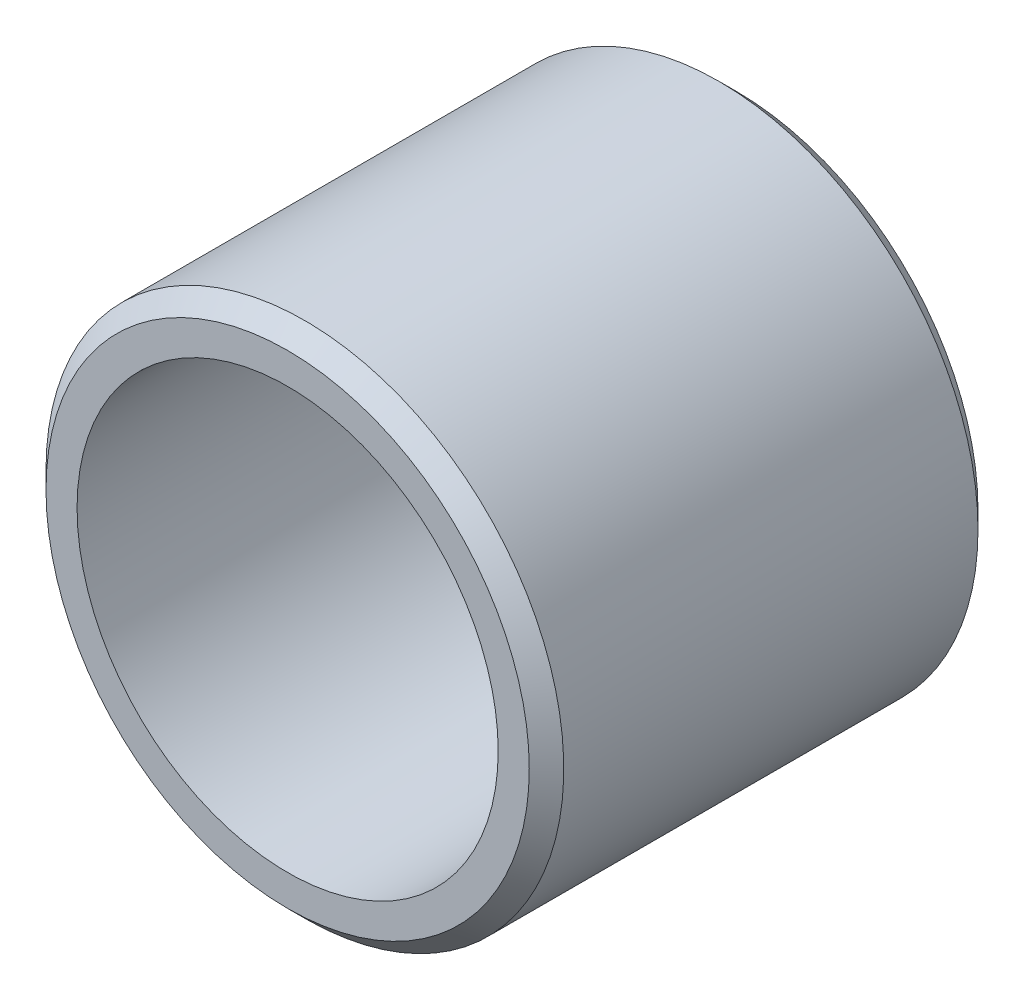
ISO-10303-21;
HEADER;
FILE_DESCRIPTION(('STEP AP214'),'2;1');
FILE_NAME('part.step','',(''),(''),'','','');
FILE_SCHEMA(('AUTOMOTIVE_DESIGN { 1 0 10303 214 1 1 1 1 }'));
ENDSEC;
DATA;
#1=APPLICATION_CONTEXT('core data for automotive mechanical design processes');
#2=APPLICATION_PROTOCOL_DEFINITION('international standard','automotive_design',2000,#1);
#3=PRODUCT_CONTEXT('',#1,'mechanical');
#4=PRODUCT('Part','Part','',(#3));
#5=PRODUCT_RELATED_PRODUCT_CATEGORY('part','',(#4));
#6=PRODUCT_DEFINITION_FORMATION('','',#4);
#7=PRODUCT_DEFINITION_CONTEXT('part definition',#1,'design');
#8=PRODUCT_DEFINITION('design','',#6,#7);
#9=PRODUCT_DEFINITION_SHAPE('','',#8);
#10=(LENGTH_UNIT() NAMED_UNIT(*) SI_UNIT(.MILLI.,.METRE.));
#11=(NAMED_UNIT(*) PLANE_ANGLE_UNIT() SI_UNIT($,.RADIAN.));
#12=(NAMED_UNIT(*) SI_UNIT($,.STERADIAN.) SOLID_ANGLE_UNIT());
#13=UNCERTAINTY_MEASURE_WITH_UNIT(LENGTH_MEASURE(1.E-05),#10,'distance_accuracy_value','');
#14=(GEOMETRIC_REPRESENTATION_CONTEXT(3) GLOBAL_UNCERTAINTY_ASSIGNED_CONTEXT((#13)) GLOBAL_UNIT_ASSIGNED_CONTEXT((#10,
#11,#12)) REPRESENTATION_CONTEXT('',''));
#15=CARTESIAN_POINT('',(0.,0.,0.));
#16=DIRECTION('',(0.,0.,1.));
#17=DIRECTION('',(1.,0.,0.));
#18=AXIS2_PLACEMENT_3D('',#15,#16,#17);
#19=CARTESIAN_POINT('',(0.,0.,13.));
#20=DIRECTION('',(0.,0.,-1.));
#21=DIRECTION('',(-1.,0.,0.));
#22=AXIS2_PLACEMENT_3D('',#19,#20,#21);
#23=CYLINDRICAL_SURFACE('',#22,6.1);
#24=CARTESIAN_POINT('',(0.,0.,0.));
#25=DIRECTION('',(0.,0.,-1.));
#26=DIRECTION('',(-1.,0.,0.));
#27=AXIS2_PLACEMENT_3D('',#24,#25,#26);
#28=CIRCLE('',#27,6.1);
#29=CARTESIAN_POINT('',(-6.1,0.,0.));
#30=VERTEX_POINT('',#29);
#31=EDGE_CURVE('E34',#30,#30,#28,.T.);
#32=ORIENTED_EDGE('',*,*,#31,.T.);
#33=EDGE_LOOP('',(#32));
#34=FACE_BOUND('',#33,.T.);
#35=CARTESIAN_POINT('',(0.,0.,13.));
#36=DIRECTION('',(0.,0.,-1.));
#37=DIRECTION('',(-1.,0.,0.));
#38=AXIS2_PLACEMENT_3D('',#35,#36,#37);
#39=CIRCLE('',#38,6.1);
#40=CARTESIAN_POINT('',(-6.1,0.,13.));
#41=VERTEX_POINT('',#40);
#42=EDGE_CURVE('E18',#41,#41,#39,.T.);
#43=ORIENTED_EDGE('',*,*,#42,.F.);
#44=EDGE_LOOP('',(#43));
#45=FACE_BOUND('',#44,.T.);
#46=ADVANCED_FACE('F15',(#34,#45),#23,.F.);
#47=CARTESIAN_POINT('',(0.,0.,13.));
#48=DIRECTION('',(0.,0.,1.));
#49=DIRECTION('',(1.,0.,0.));
#50=AXIS2_PLACEMENT_3D('',#47,#48,#49);
#51=PLANE('',#50);
#52=ORIENTED_EDGE('',*,*,#42,.T.);
#53=EDGE_LOOP('',(#52));
#54=FACE_BOUND('',#53,.T.);
#55=CARTESIAN_POINT('',(0.,0.,13.));
#56=DIRECTION('',(0.,0.,-1.));
#57=DIRECTION('',(-1.,0.,0.));
#58=AXIS2_PLACEMENT_3D('',#55,#56,#57);
#59=CIRCLE('',#58,7.00000000000002);
#60=CARTESIAN_POINT('',(-7.00000000000002,0.,13.));
#61=VERTEX_POINT('',#60);
#62=EDGE_CURVE('E32',#61,#61,#59,.T.);
#63=ORIENTED_EDGE('',*,*,#62,.F.);
#64=EDGE_LOOP('',(#63));
#65=FACE_BOUND('',#64,.T.);
#66=ADVANCED_FACE('F41',(#54,#65),#51,.T.);
#67=CARTESIAN_POINT('',(0.,0.,0.));
#68=DIRECTION('',(0.,0.,1.));
#69=DIRECTION('',(1.,0.,0.));
#70=AXIS2_PLACEMENT_3D('',#67,#68,#69);
#71=PLANE('',#70);
#72=ORIENTED_EDGE('',*,*,#31,.F.);
#73=EDGE_LOOP('',(#72));
#74=FACE_BOUND('',#73,.T.);
#75=CARTESIAN_POINT('',(0.,0.,0.));
#76=DIRECTION('',(0.,0.,1.));
#77=DIRECTION('',(1.,0.,0.));
#78=AXIS2_PLACEMENT_3D('',#75,#76,#77);
#79=CIRCLE('',#78,6.99999999999998);
#80=CARTESIAN_POINT('',(6.99999999999998,0.,0.));
#81=VERTEX_POINT('',#80);
#82=EDGE_CURVE('E27',#81,#81,#79,.T.);
#83=ORIENTED_EDGE('',*,*,#82,.F.);
#84=EDGE_LOOP('',(#83));
#85=FACE_BOUND('',#84,.T.);
#86=ADVANCED_FACE('F49',(#74,#85),#71,.F.);
#87=CARTESIAN_POINT('',(0.,0.,12.5));
#88=DIRECTION('',(0.,0.,-1.));
#89=DIRECTION('',(-1.,0.,0.));
#90=AXIS2_PLACEMENT_3D('',#87,#88,#89);
#91=CONICAL_SURFACE('',#90,7.5,0.785398163397445);
#92=CARTESIAN_POINT('',(0.,0.,12.5));
#93=DIRECTION('',(0.,0.,-1.));
#94=DIRECTION('',(-1.,0.,0.));
#95=AXIS2_PLACEMENT_3D('',#92,#93,#94);
#96=CIRCLE('',#95,7.5);
#97=CARTESIAN_POINT('',(-7.5,0.,12.5));
#98=VERTEX_POINT('',#97);
#99=EDGE_CURVE('E22',#98,#98,#96,.T.);
#100=ORIENTED_EDGE('',*,*,#99,.F.);
#101=EDGE_LOOP('',(#100));
#102=FACE_BOUND('',#101,.T.);
#103=ORIENTED_EDGE('',*,*,#62,.T.);
#104=EDGE_LOOP('',(#103));
#105=FACE_BOUND('',#104,.T.);
#106=ADVANCED_FACE('F58',(#102,#105),#91,.T.);
#107=CARTESIAN_POINT('',(0.,0.,0.500000000000019));
#108=DIRECTION('',(0.,0.,1.));
#109=DIRECTION('',(1.,0.,0.));
#110=AXIS2_PLACEMENT_3D('',#107,#108,#109);
#111=CONICAL_SURFACE('',#110,7.5,0.785398163397451);
#112=CARTESIAN_POINT('',(0.,0.,0.50000000000002));
#113=DIRECTION('',(0.,0.,-1.));
#114=DIRECTION('',(-1.,0.,0.));
#115=AXIS2_PLACEMENT_3D('',#112,#113,#114);
#116=CIRCLE('',#115,7.5);
#117=CARTESIAN_POINT('',(-7.5,0.,0.50000000000002));
#118=VERTEX_POINT('',#117);
#119=EDGE_CURVE('E10',#118,#118,#116,.F.);
#120=ORIENTED_EDGE('',*,*,#119,.F.);
#121=EDGE_LOOP('',(#120));
#122=FACE_BOUND('',#121,.T.);
#123=ORIENTED_EDGE('',*,*,#82,.T.);
#124=EDGE_LOOP('',(#123));
#125=FACE_BOUND('',#124,.T.);
#126=ADVANCED_FACE('F52',(#122,#125),#111,.T.);
#127=CARTESIAN_POINT('',(0.,0.,13.));
#128=DIRECTION('',(0.,0.,-1.));
#129=DIRECTION('',(-1.,0.,0.));
#130=AXIS2_PLACEMENT_3D('',#127,#128,#129);
#131=CYLINDRICAL_SURFACE('',#130,7.5);
#132=ORIENTED_EDGE('',*,*,#119,.T.);
#133=EDGE_LOOP('',(#132));
#134=FACE_BOUND('',#133,.T.);
#135=ORIENTED_EDGE('',*,*,#99,.T.);
#136=EDGE_LOOP('',(#135));
#137=FACE_BOUND('',#136,.T.);
#138=ADVANCED_FACE('F50',(#134,#137),#131,.T.);
#139=CLOSED_SHELL('',(#46,#66,#86,#106,#126,#138));
#140=MANIFOLD_SOLID_BREP('B1',#139);
#141=ADVANCED_BREP_SHAPE_REPRESENTATION('',(#18,#140),#14);
#142=SHAPE_DEFINITION_REPRESENTATION(#9,#141);
ENDSEC;
END-ISO-10303-21;
